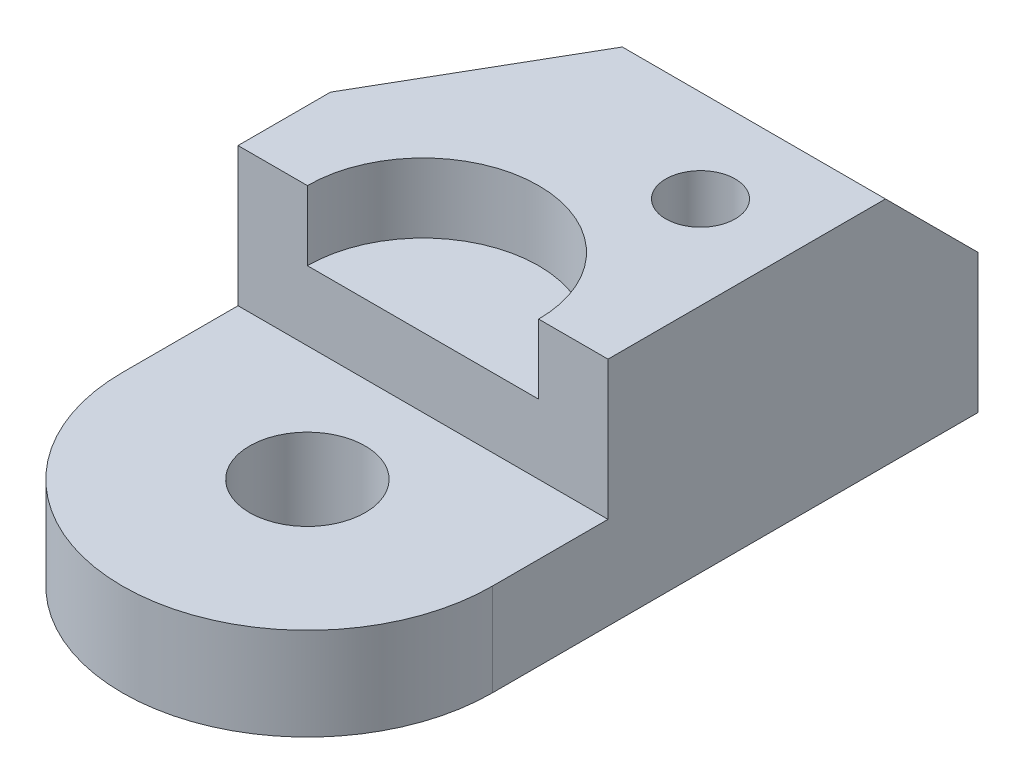
ISO-10303-21;
HEADER;
FILE_DESCRIPTION(('STEP AP214'),'2;1');
FILE_NAME('part.step','',(''),(''),'','','');
FILE_SCHEMA(('AUTOMOTIVE_DESIGN { 1 0 10303 214 1 1 1 1 }'));
ENDSEC;
DATA;
#1=APPLICATION_CONTEXT('core data for automotive mechanical design processes');
#2=APPLICATION_PROTOCOL_DEFINITION('international standard','automotive_design',2000,#1);
#3=PRODUCT_CONTEXT('',#1,'mechanical');
#4=PRODUCT('Part','Part','',(#3));
#5=PRODUCT_RELATED_PRODUCT_CATEGORY('part','',(#4));
#6=PRODUCT_DEFINITION_FORMATION('','',#4);
#7=PRODUCT_DEFINITION_CONTEXT('part definition',#1,'design');
#8=PRODUCT_DEFINITION('design','',#6,#7);
#9=PRODUCT_DEFINITION_SHAPE('','',#8);
#10=(LENGTH_UNIT() NAMED_UNIT(*) SI_UNIT(.MILLI.,.METRE.));
#11=(NAMED_UNIT(*) PLANE_ANGLE_UNIT() SI_UNIT($,.RADIAN.));
#12=(NAMED_UNIT(*) SI_UNIT($,.STERADIAN.) SOLID_ANGLE_UNIT());
#13=UNCERTAINTY_MEASURE_WITH_UNIT(LENGTH_MEASURE(1.E-05),#10,'distance_accuracy_value','');
#14=(GEOMETRIC_REPRESENTATION_CONTEXT(3) GLOBAL_UNCERTAINTY_ASSIGNED_CONTEXT((#13)) GLOBAL_UNIT_ASSIGNED_CONTEXT((#10,
#11,#12)) REPRESENTATION_CONTEXT('',''));
#15=CARTESIAN_POINT('',(0.,0.,0.));
#16=DIRECTION('',(0.,0.,1.));
#17=DIRECTION('',(1.,0.,0.));
#18=AXIS2_PLACEMENT_3D('',#15,#16,#17);
#19=CARTESIAN_POINT('',(-50.8,25.4,0.));
#20=DIRECTION('',(1.,0.,0.));
#21=DIRECTION('',(0.,0.,-1.));
#22=AXIS2_PLACEMENT_3D('',#19,#20,#21);
#23=PLANE('',#22);
#24=DIRECTION('',(0.,0.,1.));
#25=VECTOR('',#24,1.);
#26=CARTESIAN_POINT('',(-50.8,0.,0.));
#27=LINE('',#26,#25);
#28=CARTESIAN_POINT('',(-50.8,0.,-25.4));
#29=VERTEX_POINT('',#28);
#30=CARTESIAN_POINT('',(-50.8,0.,31.75));
#31=VERTEX_POINT('',#30);
#32=EDGE_CURVE('E208',#29,#31,#27,.T.);
#33=ORIENTED_EDGE('',*,*,#32,.T.);
#34=DIRECTION('',(0.,-1.,0.));
#35=VECTOR('',#34,1.);
#36=CARTESIAN_POINT('',(-50.8,25.4,31.75));
#37=LINE('',#36,#35);
#38=CARTESIAN_POINT('',(-50.8,25.4,31.75));
#39=VERTEX_POINT('',#38);
#40=EDGE_CURVE('E238',#39,#31,#37,.T.);
#41=ORIENTED_EDGE('',*,*,#40,.F.);
#42=DIRECTION('',(0.,0.,1.));
#43=VECTOR('',#42,1.);
#44=CARTESIAN_POINT('',(-50.8,25.4,0.));
#45=LINE('',#44,#43);
#46=CARTESIAN_POINT('',(-50.8,25.4,0.));
#47=VERTEX_POINT('',#46);
#48=EDGE_CURVE('E209',#47,#39,#45,.T.);
#49=ORIENTED_EDGE('',*,*,#48,.F.);
#50=DIRECTION('',(0.,-1.,0.));
#51=VECTOR('',#50,1.);
#52=CARTESIAN_POINT('',(-50.8,63.5,0.));
#53=LINE('',#52,#51);
#54=CARTESIAN_POINT('',(-50.8,63.5,0.));
#55=VERTEX_POINT('',#54);
#56=EDGE_CURVE('E183',#55,#47,#53,.T.);
#57=ORIENTED_EDGE('',*,*,#56,.F.);
#58=DIRECTION('',(0.,0.,1.));
#59=VECTOR('',#58,1.);
#60=CARTESIAN_POINT('',(-50.8,63.5,0.));
#61=LINE('',#60,#59);
#62=CARTESIAN_POINT('',(-50.8,63.5,-25.4));
#63=VERTEX_POINT('',#62);
#64=EDGE_CURVE('E180',#63,#55,#61,.T.);
#65=ORIENTED_EDGE('',*,*,#64,.F.);
#66=DIRECTION('',(0.,-1.,0.));
#67=VECTOR('',#66,1.);
#68=CARTESIAN_POINT('',(-50.8,63.5,-25.4));
#69=LINE('',#68,#67);
#70=EDGE_CURVE('E194',#63,#29,#69,.T.);
#71=ORIENTED_EDGE('',*,*,#70,.T.);
#72=EDGE_LOOP('',(#33,#41,#49,#57,#65,#71));
#73=FACE_BOUND('',#72,.T.);
#74=ADVANCED_FACE('F54',(#73),#23,.F.);
#75=CARTESIAN_POINT('',(0.,25.4,31.75));
#76=DIRECTION('',(0.,-1.,0.));
#77=DIRECTION('',(0.,0.,-1.));
#78=AXIS2_PLACEMENT_3D('',#75,#76,#77);
#79=CYLINDRICAL_SURFACE('',#78,50.8);
#80=CARTESIAN_POINT('',(0.,0.,31.75));
#81=DIRECTION('',(0.,1.,0.));
#82=DIRECTION('',(0.,0.,1.));
#83=AXIS2_PLACEMENT_3D('',#80,#81,#82);
#84=CIRCLE('',#83,50.8);
#85=CARTESIAN_POINT('',(50.8,0.,31.75));
#86=VERTEX_POINT('',#85);
#87=EDGE_CURVE('E229',#31,#86,#84,.T.);
#88=ORIENTED_EDGE('',*,*,#87,.T.);
#89=DIRECTION('',(0.,-1.,0.));
#90=VECTOR('',#89,1.);
#91=CARTESIAN_POINT('',(50.8,25.4,31.75));
#92=LINE('',#91,#90);
#93=CARTESIAN_POINT('',(50.8,25.4,31.75));
#94=VERTEX_POINT('',#93);
#95=EDGE_CURVE('E225',#94,#86,#92,.T.);
#96=ORIENTED_EDGE('',*,*,#95,.F.);
#97=CARTESIAN_POINT('',(0.,25.4,31.75));
#98=DIRECTION('',(0.,1.,0.));
#99=DIRECTION('',(0.,0.,1.));
#100=AXIS2_PLACEMENT_3D('',#97,#98,#99);
#101=CIRCLE('',#100,50.8);
#102=EDGE_CURVE('E213',#39,#94,#101,.T.);
#103=ORIENTED_EDGE('',*,*,#102,.F.);
#104=ORIENTED_EDGE('',*,*,#40,.T.);
#105=EDGE_LOOP('',(#88,#96,#103,#104));
#106=FACE_BOUND('',#105,.T.);
#107=ADVANCED_FACE('F271',(#106),#79,.T.);
#108=CARTESIAN_POINT('',(50.8,25.4,0.));
#109=DIRECTION('',(1.,0.,0.));
#110=DIRECTION('',(0.,0.,-1.));
#111=AXIS2_PLACEMENT_3D('',#108,#109,#110);
#112=PLANE('',#111);
#113=DIRECTION('',(0.,-0.707106781186551,-0.707106781186544));
#114=VECTOR('',#113,1.);
#115=CARTESIAN_POINT('',(50.8,38.1,-101.6));
#116=LINE('',#115,#114);
#117=CARTESIAN_POINT('',(50.8,63.5,-76.2000000000003));
#118=VERTEX_POINT('',#117);
#119=CARTESIAN_POINT('',(50.8,38.1,-101.6));
#120=VERTEX_POINT('',#119);
#121=EDGE_CURVE('E159',#118,#120,#116,.T.);
#122=ORIENTED_EDGE('',*,*,#121,.F.);
#123=DIRECTION('',(0.,0.,-1.));
#124=VECTOR('',#123,1.);
#125=CARTESIAN_POINT('',(50.8,63.5,-101.6));
#126=LINE('',#125,#124);
#127=CARTESIAN_POINT('',(50.8,63.5,0.));
#128=VERTEX_POINT('',#127);
#129=EDGE_CURVE('E173',#128,#118,#126,.T.);
#130=ORIENTED_EDGE('',*,*,#129,.F.);
#131=DIRECTION('',(0.,-1.,0.));
#132=VECTOR('',#131,1.);
#133=CARTESIAN_POINT('',(50.8,63.5,0.));
#134=LINE('',#133,#132);
#135=CARTESIAN_POINT('',(50.8,25.4,0.));
#136=VERTEX_POINT('',#135);
#137=EDGE_CURVE('E204',#128,#136,#134,.T.);
#138=ORIENTED_EDGE('',*,*,#137,.T.);
#139=DIRECTION('',(0.,0.,1.));
#140=VECTOR('',#139,1.);
#141=CARTESIAN_POINT('',(50.8,25.4,0.));
#142=LINE('',#141,#140);
#143=EDGE_CURVE('E217',#136,#94,#142,.T.);
#144=ORIENTED_EDGE('',*,*,#143,.T.);
#145=ORIENTED_EDGE('',*,*,#95,.T.);
#146=DIRECTION('',(0.,0.,1.));
#147=VECTOR('',#146,1.);
#148=CARTESIAN_POINT('',(50.8,0.,0.));
#149=LINE('',#148,#147);
#150=CARTESIAN_POINT('',(50.8,0.,-101.6));
#151=VERTEX_POINT('',#150);
#152=EDGE_CURVE('E214',#151,#86,#149,.T.);
#153=ORIENTED_EDGE('',*,*,#152,.F.);
#154=DIRECTION('',(0.,-1.,0.));
#155=VECTOR('',#154,1.);
#156=CARTESIAN_POINT('',(50.8,63.5,-101.6));
#157=LINE('',#156,#155);
#158=EDGE_CURVE('E201',#120,#151,#157,.T.);
#159=ORIENTED_EDGE('',*,*,#158,.F.);
#160=EDGE_LOOP('',(#122,#130,#138,#144,#145,#153,#159));
#161=FACE_BOUND('',#160,.T.);
#162=ADVANCED_FACE('F260',(#161),#112,.T.);
#163=CARTESIAN_POINT('',(0.,25.4,0.));
#164=DIRECTION('',(0.,1.,0.));
#165=DIRECTION('',(0.,0.,1.));
#166=AXIS2_PLACEMENT_3D('',#163,#164,#165);
#167=PLANE('',#166);
#168=CARTESIAN_POINT('',(0.,25.4,31.75));
#169=DIRECTION('',(0.,1.,0.));
#170=DIRECTION('',(0.,0.,1.));
#171=AXIS2_PLACEMENT_3D('',#168,#169,#170);
#172=CIRCLE('',#171,15.875);
#173=CARTESIAN_POINT('',(0.,25.4,47.625));
#174=VERTEX_POINT('',#173);
#175=EDGE_CURVE('E434',#174,#174,#172,.T.);
#176=ORIENTED_EDGE('',*,*,#175,.F.);
#177=EDGE_LOOP('',(#176));
#178=FACE_BOUND('',#177,.T.);
#179=ORIENTED_EDGE('',*,*,#48,.T.);
#180=ORIENTED_EDGE('',*,*,#102,.T.);
#181=ORIENTED_EDGE('',*,*,#143,.F.);
#182=DIRECTION('',(1.,0.,0.));
#183=VECTOR('',#182,1.);
#184=CARTESIAN_POINT('',(0.,25.4,0.));
#185=LINE('',#184,#183);
#186=EDGE_CURVE('E221',#47,#136,#185,.T.);
#187=ORIENTED_EDGE('',*,*,#186,.F.);
#188=EDGE_LOOP('',(#179,#180,#181,#187));
#189=FACE_BOUND('',#188,.T.);
#190=ADVANCED_FACE('F273',(#178,#189),#167,.T.);
#191=CARTESIAN_POINT('',(0.,0.,0.));
#192=DIRECTION('',(0.,1.,0.));
#193=DIRECTION('',(0.,0.,1.));
#194=AXIS2_PLACEMENT_3D('',#191,#192,#193);
#195=PLANE('',#194);
#196=CARTESIAN_POINT('',(0.,0.,31.75));
#197=DIRECTION('',(0.,1.,0.));
#198=DIRECTION('',(0.,0.,1.));
#199=AXIS2_PLACEMENT_3D('',#196,#197,#198);
#200=CIRCLE('',#199,15.875);
#201=CARTESIAN_POINT('',(0.,0.,47.625));
#202=VERTEX_POINT('',#201);
#203=EDGE_CURVE('E432',#202,#202,#200,.T.);
#204=ORIENTED_EDGE('',*,*,#203,.T.);
#205=EDGE_LOOP('',(#204));
#206=FACE_BOUND('',#205,.T.);
#207=CARTESIAN_POINT('',(25.4,0.,-50.8));
#208=DIRECTION('',(0.,1.,0.));
#209=DIRECTION('',(0.,0.,1.));
#210=AXIS2_PLACEMENT_3D('',#207,#208,#209);
#211=CIRCLE('',#210,9.52499999999999);
#212=CARTESIAN_POINT('',(25.4,0.,-41.275));
#213=VERTEX_POINT('',#212);
#214=EDGE_CURVE('E155',#213,#213,#211,.T.);
#215=ORIENTED_EDGE('',*,*,#214,.T.);
#216=EDGE_LOOP('',(#215));
#217=FACE_BOUND('',#216,.T.);
#218=ORIENTED_EDGE('',*,*,#32,.F.);
#219=DIRECTION('',(-0.500000000000001,0.,0.866025403784438));
#220=VECTOR('',#219,1.);
#221=CARTESIAN_POINT('',(-50.8,0.,-25.4));
#222=LINE('',#221,#220);
#223=CARTESIAN_POINT('',(-6.80590948775041,0.,-101.6));
#224=VERTEX_POINT('',#223);
#225=EDGE_CURVE('E187',#224,#29,#222,.T.);
#226=ORIENTED_EDGE('',*,*,#225,.F.);
#227=DIRECTION('',(-1.,0.,0.));
#228=VECTOR('',#227,1.);
#229=CARTESIAN_POINT('',(-6.80590948775041,0.,-101.6));
#230=LINE('',#229,#228);
#231=EDGE_CURVE('E168',#151,#224,#230,.T.);
#232=ORIENTED_EDGE('',*,*,#231,.F.);
#233=ORIENTED_EDGE('',*,*,#152,.T.);
#234=ORIENTED_EDGE('',*,*,#87,.F.);
#235=EDGE_LOOP('',(#218,#226,#232,#233,#234));
#236=FACE_BOUND('',#235,.T.);
#237=ADVANCED_FACE('F268',(#206,#217,#236),#195,.F.);
#238=CARTESIAN_POINT('',(50.8,63.5,0.));
#239=DIRECTION('',(0.,0.,-1.));
#240=DIRECTION('',(-1.,0.,0.));
#241=AXIS2_PLACEMENT_3D('',#238,#239,#240);
#242=PLANE('',#241);
#243=DIRECTION('',(1.,0.,0.));
#244=VECTOR('',#243,1.);
#245=CARTESIAN_POINT('',(50.8,44.45,0.));
#246=LINE('',#245,#244);
#247=CARTESIAN_POINT('',(-31.75,44.45,0.));
#248=VERTEX_POINT('',#247);
#249=CARTESIAN_POINT('',(31.75,44.45,0.));
#250=VERTEX_POINT('',#249);
#251=EDGE_CURVE('E13',#248,#250,#246,.T.);
#252=ORIENTED_EDGE('',*,*,#251,.F.);
#253=DIRECTION('',(0.,1.,0.));
#254=VECTOR('',#253,1.);
#255=CARTESIAN_POINT('',(-31.75,44.45,0.));
#256=LINE('',#255,#254);
#257=CARTESIAN_POINT('',(-31.75,63.5,0.));
#258=VERTEX_POINT('',#257);
#259=EDGE_CURVE('E136',#248,#258,#256,.T.);
#260=ORIENTED_EDGE('',*,*,#259,.T.);
#261=DIRECTION('',(1.,0.,0.));
#262=VECTOR('',#261,1.);
#263=CARTESIAN_POINT('',(50.8,63.5,0.));
#264=LINE('',#263,#262);
#265=EDGE_CURVE('E169',#55,#258,#264,.T.);
#266=ORIENTED_EDGE('',*,*,#265,.F.);
#267=ORIENTED_EDGE('',*,*,#56,.T.);
#268=ORIENTED_EDGE('',*,*,#186,.T.);
#269=ORIENTED_EDGE('',*,*,#137,.F.);
#270=CARTESIAN_POINT('',(31.75,63.5,0.));
#271=VERTEX_POINT('',#270);
#272=EDGE_CURVE('E143',#271,#128,#264,.T.);
#273=ORIENTED_EDGE('',*,*,#272,.F.);
#274=DIRECTION('',(0.,1.,0.));
#275=VECTOR('',#274,1.);
#276=CARTESIAN_POINT('',(31.75,44.45,0.));
#277=LINE('',#276,#275);
#278=EDGE_CURVE('E69',#271,#250,#277,.F.);
#279=ORIENTED_EDGE('',*,*,#278,.T.);
#280=EDGE_LOOP('',(#252,#260,#266,#267,#268,#269,#273,#279));
#281=FACE_BOUND('',#280,.T.);
#282=ADVANCED_FACE('F141',(#281),#242,.F.);
#283=CARTESIAN_POINT('',(-6.80590948775041,63.5,-101.6));
#284=DIRECTION('',(0.,0.,1.));
#285=DIRECTION('',(1.,0.,0.));
#286=AXIS2_PLACEMENT_3D('',#283,#284,#285);
#287=PLANE('',#286);
#288=DIRECTION('',(0.,-1.,0.));
#289=VECTOR('',#288,1.);
#290=CARTESIAN_POINT('',(-6.80590948775041,63.5,-101.6));
#291=LINE('',#290,#289);
#292=CARTESIAN_POINT('',(-6.8059094877504,38.1,-101.6));
#293=VERTEX_POINT('',#292);
#294=EDGE_CURVE('E198',#293,#224,#291,.T.);
#295=ORIENTED_EDGE('',*,*,#294,.F.);
#296=DIRECTION('',(1.,0.,0.));
#297=VECTOR('',#296,1.);
#298=CARTESIAN_POINT('',(-50.8,38.1,-101.6));
#299=LINE('',#298,#297);
#300=EDGE_CURVE('E162',#293,#120,#299,.T.);
#301=ORIENTED_EDGE('',*,*,#300,.T.);
#302=ORIENTED_EDGE('',*,*,#158,.T.);
#303=ORIENTED_EDGE('',*,*,#231,.T.);
#304=EDGE_LOOP('',(#295,#301,#302,#303));
#305=FACE_BOUND('',#304,.T.);
#306=ADVANCED_FACE('F265',(#305),#287,.F.);
#307=CARTESIAN_POINT('',(-50.8,63.5,-25.4));
#308=DIRECTION('',(0.866025403784438,0.,0.500000000000001));
#309=DIRECTION('',(0.500000000000001,0.,-0.866025403784438));
#310=AXIS2_PLACEMENT_3D('',#307,#308,#309);
#311=PLANE('',#310);
#312=DIRECTION('',(-0.500000000000001,0.,0.866025403784438));
#313=VECTOR('',#312,1.);
#314=CARTESIAN_POINT('',(-50.8,63.5,-25.4));
#315=LINE('',#314,#313);
#316=CARTESIAN_POINT('',(-21.4706063251668,63.5,-76.2000000000003));
#317=VERTEX_POINT('',#316);
#318=EDGE_CURVE('E177',#317,#63,#315,.T.);
#319=ORIENTED_EDGE('',*,*,#318,.F.);
#320=DIRECTION('',(0.377964473009226,-0.654653670707981,-0.654653670707974));
#321=VECTOR('',#320,1.);
#322=CARTESIAN_POINT('',(-38.2302598536428,92.5285714285716,-47.1714285714289));
#323=LINE('',#322,#321);
#324=EDGE_CURVE('E77',#317,#293,#323,.T.);
#325=ORIENTED_EDGE('',*,*,#324,.T.);
#326=ORIENTED_EDGE('',*,*,#294,.T.);
#327=ORIENTED_EDGE('',*,*,#225,.T.);
#328=ORIENTED_EDGE('',*,*,#70,.F.);
#329=EDGE_LOOP('',(#319,#325,#326,#327,#328));
#330=FACE_BOUND('',#329,.T.);
#331=ADVANCED_FACE('F250',(#330),#311,.F.);
#332=CARTESIAN_POINT('',(0.,63.5,0.));
#333=DIRECTION('',(0.,-1.,0.));
#334=DIRECTION('',(0.,0.,-1.));
#335=AXIS2_PLACEMENT_3D('',#332,#333,#334);
#336=PLANE('',#335);
#337=CARTESIAN_POINT('',(25.4,63.5,-50.8));
#338=DIRECTION('',(0.,1.,0.));
#339=DIRECTION('',(0.,0.,1.));
#340=AXIS2_PLACEMENT_3D('',#337,#338,#339);
#341=CIRCLE('',#340,9.525);
#342=CARTESIAN_POINT('',(25.4,63.5,-41.275));
#343=VERTEX_POINT('',#342);
#344=EDGE_CURVE('E148',#343,#343,#341,.T.);
#345=ORIENTED_EDGE('',*,*,#344,.F.);
#346=EDGE_LOOP('',(#345));
#347=FACE_BOUND('',#346,.T.);
#348=ORIENTED_EDGE('',*,*,#265,.T.);
#349=CARTESIAN_POINT('',(0.,63.5,0.));
#350=DIRECTION('',(0.,1.,0.));
#351=DIRECTION('',(0.,0.,1.));
#352=AXIS2_PLACEMENT_3D('',#349,#350,#351);
#353=CIRCLE('',#352,31.75);
#354=EDGE_CURVE('E138',#271,#258,#353,.T.);
#355=ORIENTED_EDGE('',*,*,#354,.F.);
#356=ORIENTED_EDGE('',*,*,#272,.T.);
#357=ORIENTED_EDGE('',*,*,#129,.T.);
#358=DIRECTION('',(-1.,0.,0.));
#359=VECTOR('',#358,1.);
#360=CARTESIAN_POINT('',(0.,63.5,-76.2000000000003));
#361=LINE('',#360,#359);
#362=EDGE_CURVE('E62',#118,#317,#361,.T.);
#363=ORIENTED_EDGE('',*,*,#362,.T.);
#364=ORIENTED_EDGE('',*,*,#318,.T.);
#365=ORIENTED_EDGE('',*,*,#64,.T.);
#366=EDGE_LOOP('',(#348,#355,#356,#357,#363,#364,#365));
#367=FACE_BOUND('',#366,.T.);
#368=ADVANCED_FACE('F245',(#347,#367),#336,.F.);
#369=CARTESIAN_POINT('',(-50.8,38.1,-101.6));
#370=DIRECTION('',(0.,-0.707106781186544,0.707106781186551));
#371=DIRECTION('',(0.,-0.707106781186551,-0.707106781186544));
#372=AXIS2_PLACEMENT_3D('',#369,#370,#371);
#373=PLANE('',#372);
#374=ORIENTED_EDGE('',*,*,#362,.F.);
#375=ORIENTED_EDGE('',*,*,#121,.T.);
#376=ORIENTED_EDGE('',*,*,#300,.F.);
#377=ORIENTED_EDGE('',*,*,#324,.F.);
#378=EDGE_LOOP('',(#374,#375,#376,#377));
#379=FACE_BOUND('',#378,.T.);
#380=ADVANCED_FACE('F263',(#379),#373,.F.);
#381=CARTESIAN_POINT('',(25.4,63.5,-50.8));
#382=DIRECTION('',(0.,1.,0.));
#383=DIRECTION('',(0.,0.,1.));
#384=AXIS2_PLACEMENT_3D('',#381,#382,#383);
#385=CYLINDRICAL_SURFACE('',#384,9.525);
#386=ORIENTED_EDGE('',*,*,#214,.F.);
#387=EDGE_LOOP('',(#386));
#388=FACE_BOUND('',#387,.T.);
#389=ORIENTED_EDGE('',*,*,#344,.T.);
#390=EDGE_LOOP('',(#389));
#391=FACE_BOUND('',#390,.T.);
#392=ADVANCED_FACE('F352',(#388,#391),#385,.F.);
#393=CARTESIAN_POINT('',(0.,44.45,0.));
#394=DIRECTION('',(0.,1.,0.));
#395=DIRECTION('',(0.,0.,1.));
#396=AXIS2_PLACEMENT_3D('',#393,#394,#395);
#397=PLANE('',#396);
#398=ORIENTED_EDGE('',*,*,#251,.T.);
#399=CARTESIAN_POINT('',(0.,44.45,0.));
#400=DIRECTION('',(0.,1.,0.));
#401=DIRECTION('',(0.,0.,1.));
#402=AXIS2_PLACEMENT_3D('',#399,#400,#401);
#403=CIRCLE('',#402,31.75);
#404=EDGE_CURVE('E132',#250,#248,#403,.T.);
#405=ORIENTED_EDGE('',*,*,#404,.T.);
#406=EDGE_LOOP('',(#398,#405));
#407=FACE_BOUND('',#406,.T.);
#408=ADVANCED_FACE('F131',(#407),#397,.T.);
#409=CARTESIAN_POINT('',(0.,44.45,0.));
#410=DIRECTION('',(0.,1.,0.));
#411=DIRECTION('',(0.,0.,1.));
#412=AXIS2_PLACEMENT_3D('',#409,#410,#411);
#413=CYLINDRICAL_SURFACE('',#412,31.75);
#414=ORIENTED_EDGE('',*,*,#404,.F.);
#415=ORIENTED_EDGE('',*,*,#278,.F.);
#416=ORIENTED_EDGE('',*,*,#354,.T.);
#417=ORIENTED_EDGE('',*,*,#259,.F.);
#418=EDGE_LOOP('',(#414,#415,#416,#417));
#419=FACE_BOUND('',#418,.T.);
#420=ADVANCED_FACE('F135',(#419),#413,.F.);
#421=CARTESIAN_POINT('',(0.,25.4,31.75));
#422=DIRECTION('',(0.,1.,0.));
#423=DIRECTION('',(0.,0.,1.));
#424=AXIS2_PLACEMENT_3D('',#421,#422,#423);
#425=CYLINDRICAL_SURFACE('',#424,15.875);
#426=ORIENTED_EDGE('',*,*,#203,.F.);
#427=EDGE_LOOP('',(#426));
#428=FACE_BOUND('',#427,.T.);
#429=ORIENTED_EDGE('',*,*,#175,.T.);
#430=EDGE_LOOP('',(#429));
#431=FACE_BOUND('',#430,.T.);
#432=ADVANCED_FACE('F375',(#428,#431),#425,.F.);
#433=CLOSED_SHELL('',(#74,#107,#162,#190,#237,#282,#306,#331,#368,#380,#392,#408,#420,#432));
#434=MANIFOLD_SOLID_BREP('B2',#433);
#435=ADVANCED_BREP_SHAPE_REPRESENTATION('',(#18,#434),#14);
#436=SHAPE_DEFINITION_REPRESENTATION(#9,#435);
ENDSEC;
END-ISO-10303-21;
